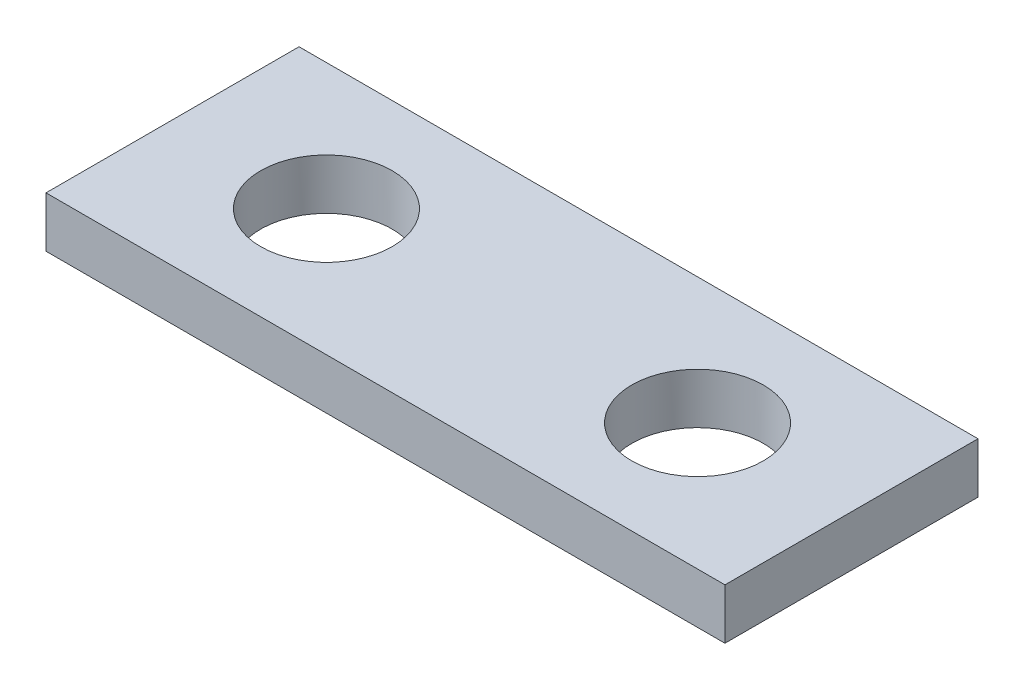
ISO-10303-21;
HEADER;
FILE_DESCRIPTION(('STEP AP214'),'2;1');
FILE_NAME('part.step','',(''),(''),'','','');
FILE_SCHEMA(('AUTOMOTIVE_DESIGN { 1 0 10303 214 1 1 1 1 }'));
ENDSEC;
DATA;
#1=APPLICATION_CONTEXT('core data for automotive mechanical design processes');
#2=APPLICATION_PROTOCOL_DEFINITION('international standard','automotive_design',2000,#1);
#3=PRODUCT_CONTEXT('',#1,'mechanical');
#4=PRODUCT('Part','Part','',(#3));
#5=PRODUCT_RELATED_PRODUCT_CATEGORY('part','',(#4));
#6=PRODUCT_DEFINITION_FORMATION('','',#4);
#7=PRODUCT_DEFINITION_CONTEXT('part definition',#1,'design');
#8=PRODUCT_DEFINITION('design','',#6,#7);
#9=PRODUCT_DEFINITION_SHAPE('','',#8);
#10=(LENGTH_UNIT() NAMED_UNIT(*) SI_UNIT(.MILLI.,.METRE.));
#11=(NAMED_UNIT(*) PLANE_ANGLE_UNIT() SI_UNIT($,.RADIAN.));
#12=(NAMED_UNIT(*) SI_UNIT($,.STERADIAN.) SOLID_ANGLE_UNIT());
#13=UNCERTAINTY_MEASURE_WITH_UNIT(LENGTH_MEASURE(1.E-05),#10,'distance_accuracy_value','');
#14=(GEOMETRIC_REPRESENTATION_CONTEXT(3) GLOBAL_UNCERTAINTY_ASSIGNED_CONTEXT((#13)) GLOBAL_UNIT_ASSIGNED_CONTEXT((#10,
#11,#12)) REPRESENTATION_CONTEXT('',''));
#15=CARTESIAN_POINT('',(0.,0.,0.));
#16=DIRECTION('',(0.,0.,1.));
#17=DIRECTION('',(1.,0.,0.));
#18=AXIS2_PLACEMENT_3D('',#15,#16,#17);
#19=CARTESIAN_POINT('',(20.125,3.,7.5));
#20=DIRECTION('',(-1.,0.,0.));
#21=DIRECTION('',(0.,0.,1.));
#22=AXIS2_PLACEMENT_3D('',#19,#20,#21);
#23=PLANE('',#22);
#24=DIRECTION('',(0.,0.,-1.));
#25=VECTOR('',#24,1.);
#26=CARTESIAN_POINT('',(20.125,0.,7.5));
#27=LINE('',#26,#25);
#28=CARTESIAN_POINT('',(20.125,0.,7.5));
#29=VERTEX_POINT('',#28);
#30=CARTESIAN_POINT('',(20.125,0.,-7.5));
#31=VERTEX_POINT('',#30);
#32=EDGE_CURVE('E96',#29,#31,#27,.T.);
#33=ORIENTED_EDGE('',*,*,#32,.T.);
#34=DIRECTION('',(0.,-1.,0.));
#35=VECTOR('',#34,1.);
#36=CARTESIAN_POINT('',(20.125,3.,-7.5));
#37=LINE('',#36,#35);
#38=CARTESIAN_POINT('',(20.125,3.,-7.5));
#39=VERTEX_POINT('',#38);
#40=EDGE_CURVE('E11',#39,#31,#37,.T.);
#41=ORIENTED_EDGE('',*,*,#40,.F.);
#42=DIRECTION('',(0.,0.,-1.));
#43=VECTOR('',#42,1.);
#44=CARTESIAN_POINT('',(20.125,3.,7.5));
#45=LINE('',#44,#43);
#46=CARTESIAN_POINT('',(20.125,3.,7.5));
#47=VERTEX_POINT('',#46);
#48=EDGE_CURVE('E84',#47,#39,#45,.T.);
#49=ORIENTED_EDGE('',*,*,#48,.F.);
#50=DIRECTION('',(0.,-1.,0.));
#51=VECTOR('',#50,1.);
#52=CARTESIAN_POINT('',(20.125,3.,7.5));
#53=LINE('',#52,#51);
#54=EDGE_CURVE('E92',#47,#29,#53,.T.);
#55=ORIENTED_EDGE('',*,*,#54,.T.);
#56=EDGE_LOOP('',(#33,#41,#49,#55));
#57=FACE_BOUND('',#56,.T.);
#58=ADVANCED_FACE('F33',(#57),#23,.F.);
#59=CARTESIAN_POINT('',(-20.125,3.,-7.5));
#60=DIRECTION('',(0.,0.,1.));
#61=DIRECTION('',(1.,0.,0.));
#62=AXIS2_PLACEMENT_3D('',#59,#60,#61);
#63=PLANE('',#62);
#64=DIRECTION('',(-1.,0.,0.));
#65=VECTOR('',#64,1.);
#66=CARTESIAN_POINT('',(-20.125,0.,-7.5));
#67=LINE('',#66,#65);
#68=CARTESIAN_POINT('',(-20.125,0.,-7.5));
#69=VERTEX_POINT('',#68);
#70=EDGE_CURVE('E88',#31,#69,#67,.T.);
#71=ORIENTED_EDGE('',*,*,#70,.T.);
#72=DIRECTION('',(0.,-1.,0.));
#73=VECTOR('',#72,1.);
#74=CARTESIAN_POINT('',(-20.125,3.,-7.5));
#75=LINE('',#74,#73);
#76=CARTESIAN_POINT('',(-20.125,3.,-7.5));
#77=VERTEX_POINT('',#76);
#78=EDGE_CURVE('E41',#77,#69,#75,.T.);
#79=ORIENTED_EDGE('',*,*,#78,.F.);
#80=DIRECTION('',(-1.,0.,0.));
#81=VECTOR('',#80,1.);
#82=CARTESIAN_POINT('',(-20.125,3.,-7.5));
#83=LINE('',#82,#81);
#84=EDGE_CURVE('E79',#39,#77,#83,.T.);
#85=ORIENTED_EDGE('',*,*,#84,.F.);
#86=ORIENTED_EDGE('',*,*,#40,.T.);
#87=EDGE_LOOP('',(#71,#79,#85,#86));
#88=FACE_BOUND('',#87,.T.);
#89=ADVANCED_FACE('F87',(#88),#63,.F.);
#90=CARTESIAN_POINT('',(-20.125,3.,7.5));
#91=DIRECTION('',(1.,0.,0.));
#92=DIRECTION('',(0.,0.,-1.));
#93=AXIS2_PLACEMENT_3D('',#90,#91,#92);
#94=PLANE('',#93);
#95=DIRECTION('',(0.,0.,1.));
#96=VECTOR('',#95,1.);
#97=CARTESIAN_POINT('',(-20.125,0.,7.5));
#98=LINE('',#97,#96);
#99=CARTESIAN_POINT('',(-20.125,0.,7.5));
#100=VERTEX_POINT('',#99);
#101=EDGE_CURVE('E66',#69,#100,#98,.T.);
#102=ORIENTED_EDGE('',*,*,#101,.T.);
#103=DIRECTION('',(0.,-1.,0.));
#104=VECTOR('',#103,1.);
#105=CARTESIAN_POINT('',(-20.125,3.,7.5));
#106=LINE('',#105,#104);
#107=CARTESIAN_POINT('',(-20.125,3.,7.5));
#108=VERTEX_POINT('',#107);
#109=EDGE_CURVE('E89',#108,#100,#106,.T.);
#110=ORIENTED_EDGE('',*,*,#109,.F.);
#111=DIRECTION('',(0.,0.,1.));
#112=VECTOR('',#111,1.);
#113=CARTESIAN_POINT('',(-20.125,3.,7.5));
#114=LINE('',#113,#112);
#115=EDGE_CURVE('E82',#77,#108,#114,.T.);
#116=ORIENTED_EDGE('',*,*,#115,.F.);
#117=ORIENTED_EDGE('',*,*,#78,.T.);
#118=EDGE_LOOP('',(#102,#110,#116,#117));
#119=FACE_BOUND('',#118,.T.);
#120=ADVANCED_FACE('F90',(#119),#94,.F.);
#121=CARTESIAN_POINT('',(-20.125,3.,7.5));
#122=DIRECTION('',(0.,0.,-1.));
#123=DIRECTION('',(-1.,0.,0.));
#124=AXIS2_PLACEMENT_3D('',#121,#122,#123);
#125=PLANE('',#124);
#126=DIRECTION('',(1.,0.,0.));
#127=VECTOR('',#126,1.);
#128=CARTESIAN_POINT('',(-20.125,0.,7.5));
#129=LINE('',#128,#127);
#130=EDGE_CURVE('E72',#100,#29,#129,.T.);
#131=ORIENTED_EDGE('',*,*,#130,.T.);
#132=ORIENTED_EDGE('',*,*,#54,.F.);
#133=DIRECTION('',(1.,0.,0.));
#134=VECTOR('',#133,1.);
#135=CARTESIAN_POINT('',(-20.125,3.,7.5));
#136=LINE('',#135,#134);
#137=EDGE_CURVE('E49',#108,#47,#136,.T.);
#138=ORIENTED_EDGE('',*,*,#137,.F.);
#139=ORIENTED_EDGE('',*,*,#109,.T.);
#140=EDGE_LOOP('',(#131,#132,#138,#139));
#141=FACE_BOUND('',#140,.T.);
#142=ADVANCED_FACE('F104',(#141),#125,.F.);
#143=CARTESIAN_POINT('',(0.,3.,0.));
#144=DIRECTION('',(0.,-1.,0.));
#145=DIRECTION('',(0.,0.,-1.));
#146=AXIS2_PLACEMENT_3D('',#143,#144,#145);
#147=PLANE('',#146);
#148=CARTESIAN_POINT('',(11.,3.,0.));
#149=DIRECTION('',(0.,-1.,0.));
#150=DIRECTION('',(0.,0.,-1.));
#151=AXIS2_PLACEMENT_3D('',#148,#149,#150);
#152=CIRCLE('',#151,3.9);
#153=CARTESIAN_POINT('',(11.,3.,-3.9));
#154=VERTEX_POINT('',#153);
#155=EDGE_CURVE('E115',#154,#154,#152,.F.);
#156=ORIENTED_EDGE('',*,*,#155,.F.);
#157=EDGE_LOOP('',(#156));
#158=FACE_BOUND('',#157,.T.);
#159=CARTESIAN_POINT('',(-11.,3.,0.));
#160=DIRECTION('',(0.,-1.,0.));
#161=DIRECTION('',(0.,0.,-1.));
#162=AXIS2_PLACEMENT_3D('',#159,#160,#161);
#163=CIRCLE('',#162,3.9);
#164=CARTESIAN_POINT('',(-11.,3.,-3.9));
#165=VERTEX_POINT('',#164);
#166=EDGE_CURVE('E99',#165,#165,#163,.T.);
#167=ORIENTED_EDGE('',*,*,#166,.T.);
#168=EDGE_LOOP('',(#167));
#169=FACE_BOUND('',#168,.T.);
#170=ORIENTED_EDGE('',*,*,#48,.T.);
#171=ORIENTED_EDGE('',*,*,#84,.T.);
#172=ORIENTED_EDGE('',*,*,#115,.T.);
#173=ORIENTED_EDGE('',*,*,#137,.T.);
#174=EDGE_LOOP('',(#170,#171,#172,#173));
#175=FACE_BOUND('',#174,.T.);
#176=ADVANCED_FACE('F80',(#158,#169,#175),#147,.F.);
#177=CARTESIAN_POINT('',(0.,0.,0.));
#178=DIRECTION('',(0.,-1.,0.));
#179=DIRECTION('',(0.,0.,-1.));
#180=AXIS2_PLACEMENT_3D('',#177,#178,#179);
#181=PLANE('',#180);
#182=CARTESIAN_POINT('',(11.,0.,0.));
#183=DIRECTION('',(0.,-1.,0.));
#184=DIRECTION('',(0.,0.,1.));
#185=AXIS2_PLACEMENT_3D('',#182,#183,#184);
#186=CIRCLE('',#185,3.9);
#187=CARTESIAN_POINT('',(11.,0.,3.9));
#188=VERTEX_POINT('',#187);
#189=EDGE_CURVE('E118',#188,#188,#186,.T.);
#190=ORIENTED_EDGE('',*,*,#189,.F.);
#191=EDGE_LOOP('',(#190));
#192=FACE_BOUND('',#191,.T.);
#193=CARTESIAN_POINT('',(-11.,0.,0.));
#194=DIRECTION('',(0.,1.,0.));
#195=DIRECTION('',(0.,0.,1.));
#196=AXIS2_PLACEMENT_3D('',#193,#194,#195);
#197=CIRCLE('',#196,3.9);
#198=CARTESIAN_POINT('',(-11.,0.,3.9));
#199=VERTEX_POINT('',#198);
#200=EDGE_CURVE('E112',#199,#199,#197,.T.);
#201=ORIENTED_EDGE('',*,*,#200,.T.);
#202=EDGE_LOOP('',(#201));
#203=FACE_BOUND('',#202,.T.);
#204=ORIENTED_EDGE('',*,*,#32,.F.);
#205=ORIENTED_EDGE('',*,*,#130,.F.);
#206=ORIENTED_EDGE('',*,*,#101,.F.);
#207=ORIENTED_EDGE('',*,*,#70,.F.);
#208=EDGE_LOOP('',(#204,#205,#206,#207));
#209=FACE_BOUND('',#208,.T.);
#210=ADVANCED_FACE('F107',(#192,#203,#209),#181,.T.);
#211=CARTESIAN_POINT('',(-11.,0.,0.));
#212=DIRECTION('',(0.,1.,0.));
#213=DIRECTION('',(0.,0.,1.));
#214=AXIS2_PLACEMENT_3D('',#211,#212,#213);
#215=CYLINDRICAL_SURFACE('',#214,3.9);
#216=ORIENTED_EDGE('',*,*,#200,.F.);
#217=EDGE_LOOP('',(#216));
#218=FACE_BOUND('',#217,.T.);
#219=ORIENTED_EDGE('',*,*,#166,.F.);
#220=EDGE_LOOP('',(#219));
#221=FACE_BOUND('',#220,.T.);
#222=ADVANCED_FACE('F127',(#218,#221),#215,.F.);
#223=CARTESIAN_POINT('',(11.,0.,0.));
#224=DIRECTION('',(0.,1.,0.));
#225=DIRECTION('',(0.,0.,1.));
#226=AXIS2_PLACEMENT_3D('',#223,#224,#225);
#227=CYLINDRICAL_SURFACE('',#226,3.9);
#228=ORIENTED_EDGE('',*,*,#189,.T.);
#229=EDGE_LOOP('',(#228));
#230=FACE_BOUND('',#229,.T.);
#231=ORIENTED_EDGE('',*,*,#155,.T.);
#232=EDGE_LOOP('',(#231));
#233=FACE_BOUND('',#232,.T.);
#234=ADVANCED_FACE('F122',(#230,#233),#227,.F.);
#235=CLOSED_SHELL('',(#58,#89,#120,#142,#176,#210,#222,#234));
#236=MANIFOLD_SOLID_BREP('B2',#235);
#237=ADVANCED_BREP_SHAPE_REPRESENTATION('',(#18,#236),#14);
#238=SHAPE_DEFINITION_REPRESENTATION(#9,#237);
ENDSEC;
END-ISO-10303-21;
